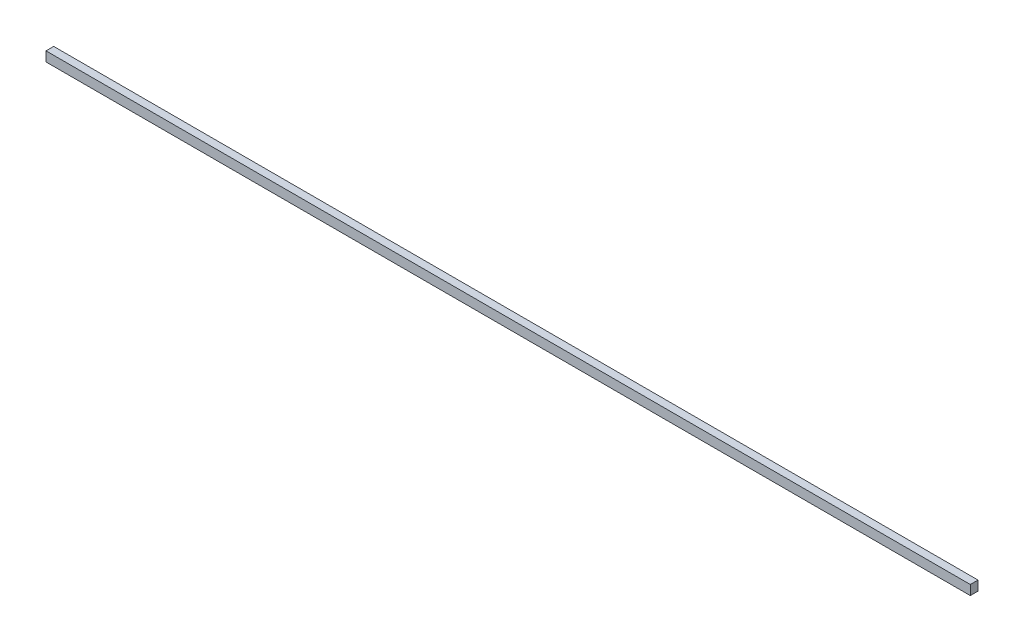
ISO-10303-21;
HEADER;
FILE_DESCRIPTION(('STEP AP214'),'2;1');
FILE_NAME('part.step','',(''),(''),'','','');
FILE_SCHEMA(('AUTOMOTIVE_DESIGN { 1 0 10303 214 1 1 1 1 }'));
ENDSEC;
DATA;
#1=APPLICATION_CONTEXT('core data for automotive mechanical design processes');
#2=APPLICATION_PROTOCOL_DEFINITION('international standard','automotive_design',2000,#1);
#3=PRODUCT_CONTEXT('',#1,'mechanical');
#4=PRODUCT('Part','Part','',(#3));
#5=PRODUCT_RELATED_PRODUCT_CATEGORY('part','',(#4));
#6=PRODUCT_DEFINITION_FORMATION('','',#4);
#7=PRODUCT_DEFINITION_CONTEXT('part definition',#1,'design');
#8=PRODUCT_DEFINITION('design','',#6,#7);
#9=PRODUCT_DEFINITION_SHAPE('','',#8);
#10=(LENGTH_UNIT() NAMED_UNIT(*) SI_UNIT(.MILLI.,.METRE.));
#11=(NAMED_UNIT(*) PLANE_ANGLE_UNIT() SI_UNIT($,.RADIAN.));
#12=(NAMED_UNIT(*) SI_UNIT($,.STERADIAN.) SOLID_ANGLE_UNIT());
#13=UNCERTAINTY_MEASURE_WITH_UNIT(LENGTH_MEASURE(1.E-05),#10,'distance_accuracy_value','');
#14=(GEOMETRIC_REPRESENTATION_CONTEXT(3) GLOBAL_UNCERTAINTY_ASSIGNED_CONTEXT((#13)) GLOBAL_UNIT_ASSIGNED_CONTEXT((#10,
#11,#12)) REPRESENTATION_CONTEXT('',''));
#15=CARTESIAN_POINT('',(0.,0.,0.));
#16=DIRECTION('',(0.,0.,1.));
#17=DIRECTION('',(1.,0.,0.));
#18=AXIS2_PLACEMENT_3D('',#15,#16,#17);
#19=CARTESIAN_POINT('',(304.800000000002,-3.175,2.54));
#20=DIRECTION('',(-1.,0.,0.));
#21=DIRECTION('',(0.,0.,1.));
#22=AXIS2_PLACEMENT_3D('',#19,#20,#21);
#23=PLANE('',#22);
#24=DIRECTION('',(0.,1.,0.));
#25=VECTOR('',#24,1.);
#26=CARTESIAN_POINT('',(304.800000000002,-3.175,-2.54));
#27=LINE('',#26,#25);
#28=CARTESIAN_POINT('',(304.800000000002,-3.175,-2.54));
#29=VERTEX_POINT('',#28);
#30=CARTESIAN_POINT('',(304.800000000002,3.175,-2.54));
#31=VERTEX_POINT('',#30);
#32=EDGE_CURVE('E113',#29,#31,#27,.T.);
#33=ORIENTED_EDGE('',*,*,#32,.T.);
#34=DIRECTION('',(0.,0.,-1.));
#35=VECTOR('',#34,1.);
#36=CARTESIAN_POINT('',(304.800000000002,3.175,2.54));
#37=LINE('',#36,#35);
#38=CARTESIAN_POINT('',(304.800000000002,3.175,2.54));
#39=VERTEX_POINT('',#38);
#40=EDGE_CURVE('E11',#39,#31,#37,.T.);
#41=ORIENTED_EDGE('',*,*,#40,.F.);
#42=DIRECTION('',(0.,1.,0.));
#43=VECTOR('',#42,1.);
#44=CARTESIAN_POINT('',(304.800000000002,-3.175,2.54));
#45=LINE('',#44,#43);
#46=CARTESIAN_POINT('',(304.800000000002,-3.175,2.54));
#47=VERTEX_POINT('',#46);
#48=EDGE_CURVE('E97',#47,#39,#45,.T.);
#49=ORIENTED_EDGE('',*,*,#48,.F.);
#50=DIRECTION('',(0.,0.,-1.));
#51=VECTOR('',#50,1.);
#52=CARTESIAN_POINT('',(304.800000000002,-3.175,2.54));
#53=LINE('',#52,#51);
#54=EDGE_CURVE('E109',#47,#29,#53,.T.);
#55=ORIENTED_EDGE('',*,*,#54,.T.);
#56=EDGE_LOOP('',(#33,#41,#49,#55));
#57=FACE_BOUND('',#56,.T.);
#58=ADVANCED_FACE('F45',(#57),#23,.F.);
#59=CARTESIAN_POINT('',(-304.799999999998,3.175,2.54));
#60=DIRECTION('',(0.,-1.,0.));
#61=DIRECTION('',(0.,0.,-1.));
#62=AXIS2_PLACEMENT_3D('',#59,#60,#61);
#63=PLANE('',#62);
#64=DIRECTION('',(-1.,0.,0.));
#65=VECTOR('',#64,1.);
#66=CARTESIAN_POINT('',(-304.799999999998,3.175,-2.54));
#67=LINE('',#66,#65);
#68=CARTESIAN_POINT('',(-304.799999999998,3.175,-2.54));
#69=VERTEX_POINT('',#68);
#70=EDGE_CURVE('E102',#31,#69,#67,.T.);
#71=ORIENTED_EDGE('',*,*,#70,.T.);
#72=DIRECTION('',(0.,0.,-1.));
#73=VECTOR('',#72,1.);
#74=CARTESIAN_POINT('',(-304.799999999998,3.175,2.54));
#75=LINE('',#74,#73);
#76=CARTESIAN_POINT('',(-304.799999999998,3.175,2.54));
#77=VERTEX_POINT('',#76);
#78=EDGE_CURVE('E54',#77,#69,#75,.T.);
#79=ORIENTED_EDGE('',*,*,#78,.F.);
#80=DIRECTION('',(-1.,0.,0.));
#81=VECTOR('',#80,1.);
#82=CARTESIAN_POINT('',(-304.799999999998,3.175,2.54));
#83=LINE('',#82,#81);
#84=EDGE_CURVE('E92',#39,#77,#83,.T.);
#85=ORIENTED_EDGE('',*,*,#84,.F.);
#86=ORIENTED_EDGE('',*,*,#40,.T.);
#87=EDGE_LOOP('',(#71,#79,#85,#86));
#88=FACE_BOUND('',#87,.T.);
#89=ADVANCED_FACE('F101',(#88),#63,.F.);
#90=CARTESIAN_POINT('',(-304.799999999998,-3.175,2.54));
#91=DIRECTION('',(1.,0.,0.));
#92=DIRECTION('',(0.,0.,-1.));
#93=AXIS2_PLACEMENT_3D('',#90,#91,#92);
#94=PLANE('',#93);
#95=DIRECTION('',(0.,-1.,0.));
#96=VECTOR('',#95,1.);
#97=CARTESIAN_POINT('',(-304.799999999998,-3.175,-2.54));
#98=LINE('',#97,#96);
#99=CARTESIAN_POINT('',(-304.799999999998,-3.175,-2.54));
#100=VERTEX_POINT('',#99);
#101=EDGE_CURVE('E79',#69,#100,#98,.T.);
#102=ORIENTED_EDGE('',*,*,#101,.T.);
#103=DIRECTION('',(0.,0.,-1.));
#104=VECTOR('',#103,1.);
#105=CARTESIAN_POINT('',(-304.799999999998,-3.175,2.54));
#106=LINE('',#105,#104);
#107=CARTESIAN_POINT('',(-304.799999999998,-3.175,2.54));
#108=VERTEX_POINT('',#107);
#109=EDGE_CURVE('E104',#108,#100,#106,.T.);
#110=ORIENTED_EDGE('',*,*,#109,.F.);
#111=DIRECTION('',(0.,-1.,0.));
#112=VECTOR('',#111,1.);
#113=CARTESIAN_POINT('',(-304.799999999998,-3.175,2.54));
#114=LINE('',#113,#112);
#115=EDGE_CURVE('E95',#77,#108,#114,.T.);
#116=ORIENTED_EDGE('',*,*,#115,.F.);
#117=ORIENTED_EDGE('',*,*,#78,.T.);
#118=EDGE_LOOP('',(#102,#110,#116,#117));
#119=FACE_BOUND('',#118,.T.);
#120=ADVANCED_FACE('F105',(#119),#94,.F.);
#121=CARTESIAN_POINT('',(-304.799999999998,-3.175,2.54));
#122=DIRECTION('',(0.,1.,0.));
#123=DIRECTION('',(0.,0.,1.));
#124=AXIS2_PLACEMENT_3D('',#121,#122,#123);
#125=PLANE('',#124);
#126=DIRECTION('',(1.,0.,0.));
#127=VECTOR('',#126,1.);
#128=CARTESIAN_POINT('',(-304.799999999998,-3.175,-2.54));
#129=LINE('',#128,#127);
#130=EDGE_CURVE('E85',#100,#29,#129,.T.);
#131=ORIENTED_EDGE('',*,*,#130,.T.);
#132=ORIENTED_EDGE('',*,*,#54,.F.);
#133=DIRECTION('',(1.,0.,0.));
#134=VECTOR('',#133,1.);
#135=CARTESIAN_POINT('',(-304.799999999998,-3.175,2.54));
#136=LINE('',#135,#134);
#137=EDGE_CURVE('E62',#108,#47,#136,.T.);
#138=ORIENTED_EDGE('',*,*,#137,.F.);
#139=ORIENTED_EDGE('',*,*,#109,.T.);
#140=EDGE_LOOP('',(#131,#132,#138,#139));
#141=FACE_BOUND('',#140,.T.);
#142=ADVANCED_FACE('F126',(#141),#125,.F.);
#143=CARTESIAN_POINT('',(0.,0.,2.54));
#144=DIRECTION('',(0.,0.,-1.));
#145=DIRECTION('',(-1.,0.,0.));
#146=AXIS2_PLACEMENT_3D('',#143,#144,#145);
#147=PLANE('',#146);
#148=ORIENTED_EDGE('',*,*,#48,.T.);
#149=ORIENTED_EDGE('',*,*,#84,.T.);
#150=ORIENTED_EDGE('',*,*,#115,.T.);
#151=ORIENTED_EDGE('',*,*,#137,.T.);
#152=EDGE_LOOP('',(#148,#149,#150,#151));
#153=FACE_BOUND('',#152,.T.);
#154=ADVANCED_FACE('F93',(#153),#147,.F.);
#155=CARTESIAN_POINT('',(0.,0.,-2.54));
#156=DIRECTION('',(0.,0.,-1.));
#157=DIRECTION('',(-1.,0.,0.));
#158=AXIS2_PLACEMENT_3D('',#155,#156,#157);
#159=PLANE('',#158);
#160=ORIENTED_EDGE('',*,*,#32,.F.);
#161=ORIENTED_EDGE('',*,*,#130,.F.);
#162=ORIENTED_EDGE('',*,*,#101,.F.);
#163=ORIENTED_EDGE('',*,*,#70,.F.);
#164=EDGE_LOOP('',(#160,#161,#162,#163));
#165=FACE_BOUND('',#164,.T.);
#166=ADVANCED_FACE('F129',(#165),#159,.T.);
#167=CLOSED_SHELL('',(#58,#89,#120,#142,#154,#166));
#168=MANIFOLD_SOLID_BREP('B2',#167);
#169=ADVANCED_BREP_SHAPE_REPRESENTATION('',(#18,#168),#14);
#170=SHAPE_DEFINITION_REPRESENTATION(#9,#169);
ENDSEC;
END-ISO-10303-21;
